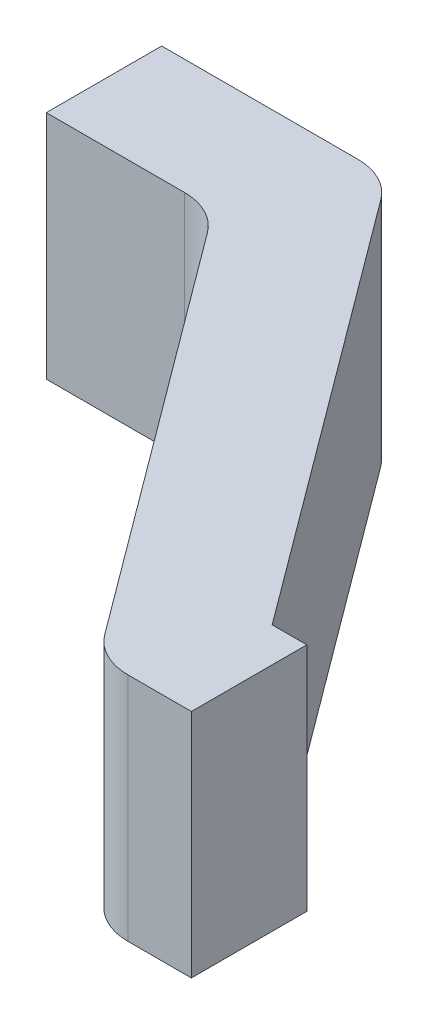
ISO-10303-21;
HEADER;
FILE_DESCRIPTION(('STEP AP214'),'2;1');
FILE_NAME('part.step','',(''),(''),'','','');
FILE_SCHEMA(('AUTOMOTIVE_DESIGN { 1 0 10303 214 1 1 1 1 }'));
ENDSEC;
DATA;
#1=APPLICATION_CONTEXT('core data for automotive mechanical design processes');
#2=APPLICATION_PROTOCOL_DEFINITION('international standard','automotive_design',2000,#1);
#3=PRODUCT_CONTEXT('',#1,'mechanical');
#4=PRODUCT('Part','Part','',(#3));
#5=PRODUCT_RELATED_PRODUCT_CATEGORY('part','',(#4));
#6=PRODUCT_DEFINITION_FORMATION('','',#4);
#7=PRODUCT_DEFINITION_CONTEXT('part definition',#1,'design');
#8=PRODUCT_DEFINITION('design','',#6,#7);
#9=PRODUCT_DEFINITION_SHAPE('','',#8);
#10=(LENGTH_UNIT() NAMED_UNIT(*) SI_UNIT(.MILLI.,.METRE.));
#11=(NAMED_UNIT(*) PLANE_ANGLE_UNIT() SI_UNIT($,.RADIAN.));
#12=(NAMED_UNIT(*) SI_UNIT($,.STERADIAN.) SOLID_ANGLE_UNIT());
#13=UNCERTAINTY_MEASURE_WITH_UNIT(LENGTH_MEASURE(1.E-05),#10,'distance_accuracy_value','');
#14=(GEOMETRIC_REPRESENTATION_CONTEXT(3) GLOBAL_UNCERTAINTY_ASSIGNED_CONTEXT((#13)) GLOBAL_UNIT_ASSIGNED_CONTEXT((#10,
#11,#12)) REPRESENTATION_CONTEXT('',''));
#15=CARTESIAN_POINT('',(0.,0.,0.));
#16=DIRECTION('',(0.,0.,1.));
#17=DIRECTION('',(1.,0.,0.));
#18=AXIS2_PLACEMENT_3D('',#15,#16,#17);
#19=CARTESIAN_POINT('',(-3.,1.7,0.205));
#20=DIRECTION('',(0.,0.,1.));
#21=DIRECTION('',(1.,0.,0.));
#22=AXIS2_PLACEMENT_3D('',#19,#20,#21);
#23=PLANE('',#22);
#24=DIRECTION('',(1.,0.,0.));
#25=VECTOR('',#24,1.);
#26=CARTESIAN_POINT('',(-3.,2.11,0.205));
#27=LINE('',#26,#25);
#28=CARTESIAN_POINT('',(-3.,2.11,0.205));
#29=VERTEX_POINT('',#28);
#30=CARTESIAN_POINT('',(-2.754632601552,2.11,0.205));
#31=VERTEX_POINT('',#30);
#32=EDGE_CURVE('E11',#29,#31,#27,.T.);
#33=ORIENTED_EDGE('',*,*,#32,.F.);
#34=DIRECTION('',(0.,1.,0.));
#35=VECTOR('',#34,1.);
#36=CARTESIAN_POINT('',(-3.,1.7,0.205));
#37=LINE('',#36,#35);
#38=CARTESIAN_POINT('',(-3.,1.7,0.205));
#39=VERTEX_POINT('',#38);
#40=EDGE_CURVE('E24',#39,#29,#37,.T.);
#41=ORIENTED_EDGE('',*,*,#40,.F.);
#42=DIRECTION('',(1.,0.,0.));
#43=VECTOR('',#42,1.);
#44=CARTESIAN_POINT('',(-3.,1.7,0.205));
#45=LINE('',#44,#43);
#46=CARTESIAN_POINT('',(-2.754632601552,1.7,0.205));
#47=VERTEX_POINT('',#46);
#48=EDGE_CURVE('E186',#39,#47,#45,.T.);
#49=ORIENTED_EDGE('',*,*,#48,.T.);
#50=DIRECTION('',(0.,1.,0.));
#51=VECTOR('',#50,1.);
#52=CARTESIAN_POINT('',(-2.754632601552,1.7,0.205));
#53=LINE('',#52,#51);
#54=EDGE_CURVE('E184',#47,#31,#53,.T.);
#55=ORIENTED_EDGE('',*,*,#54,.T.);
#56=EDGE_LOOP('',(#33,#41,#49,#55));
#57=FACE_BOUND('',#56,.T.);
#58=ADVANCED_FACE('F17',(#57),#23,.T.);
#59=CARTESIAN_POINT('',(-3.,2.11,0.));
#60=DIRECTION('',(0.,1.,0.));
#61=DIRECTION('',(0.,0.,1.));
#62=AXIS2_PLACEMENT_3D('',#59,#60,#61);
#63=PLANE('',#62);
#64=DIRECTION('',(1.,0.,0.));
#65=VECTOR('',#64,1.);
#66=CARTESIAN_POINT('',(-3.,2.11,0.));
#67=LINE('',#66,#65);
#68=CARTESIAN_POINT('',(-3.,2.11,0.));
#69=VERTEX_POINT('',#68);
#70=CARTESIAN_POINT('',(-2.651544200517,2.11,0.));
#71=VERTEX_POINT('',#70);
#72=EDGE_CURVE('E182',#69,#71,#67,.T.);
#73=ORIENTED_EDGE('',*,*,#72,.F.);
#74=DIRECTION('',(0.,0.,1.));
#75=VECTOR('',#74,1.);
#76=CARTESIAN_POINT('',(-3.,2.11,0.));
#77=LINE('',#76,#75);
#78=EDGE_CURVE('E180',#69,#29,#77,.T.);
#79=ORIENTED_EDGE('',*,*,#78,.T.);
#80=ORIENTED_EDGE('',*,*,#32,.T.);
#81=CARTESIAN_POINT('',(-2.754632601552,2.11,0.3075));
#82=DIRECTION('',(0.,-1.,0.));
#83=DIRECTION('',(0.,0.,1.));
#84=AXIS2_PLACEMENT_3D('',#81,#82,#83);
#85=CIRCLE('',#84,0.1025);
#86=CARTESIAN_POINT('',(-2.672351357136,2.11,0.246376789863));
#87=VERTEX_POINT('',#86);
#88=EDGE_CURVE('E178',#31,#87,#85,.T.);
#89=ORIENTED_EDGE('',*,*,#88,.T.);
#90=DIRECTION('',(0.596324001338072,0.,0.802743847954097));
#91=VECTOR('',#90,1.);
#92=CARTESIAN_POINT('',(-2.764562488831,2.11,0.122246420274));
#93=LINE('',#92,#91);
#94=CARTESIAN_POINT('',(-2.145299532729,2.11,0.955869630411));
#95=VERTEX_POINT('',#94);
#96=EDGE_CURVE('E176',#87,#95,#93,.T.);
#97=ORIENTED_EDGE('',*,*,#96,.T.);
#98=CARTESIAN_POINT('',(-2.063018288313,2.11,0.894746420274));
#99=DIRECTION('',(0.,1.,0.));
#100=DIRECTION('',(0.,0.,1.));
#101=AXIS2_PLACEMENT_3D('',#98,#99,#100);
#102=CIRCLE('',#101,0.1025);
#103=CARTESIAN_POINT('',(-2.063018288313,2.11,0.997246420274));
#104=VERTEX_POINT('',#103);
#105=EDGE_CURVE('E120',#95,#104,#102,.T.);
#106=ORIENTED_EDGE('',*,*,#105,.T.);
#107=DIRECTION('',(1.,0.,0.));
#108=VECTOR('',#107,1.);
#109=CARTESIAN_POINT('',(-2.114562488831,2.11,0.997246420274));
#110=LINE('',#109,#108);
#111=CARTESIAN_POINT('',(-1.95,2.11,0.997246420274));
#112=VERTEX_POINT('',#111);
#113=EDGE_CURVE('E173',#104,#112,#110,.T.);
#114=ORIENTED_EDGE('',*,*,#113,.T.);
#115=DIRECTION('',(0.,0.,1.));
#116=VECTOR('',#115,1.);
#117=CARTESIAN_POINT('',(-1.95,2.11,0.792246420274));
#118=LINE('',#117,#116);
#119=CARTESIAN_POINT('',(-1.95,2.11,0.792246420274));
#120=VERTEX_POINT('',#119);
#121=EDGE_CURVE('E170',#120,#112,#118,.T.);
#122=ORIENTED_EDGE('',*,*,#121,.F.);
#123=DIRECTION('',(1.,0.,0.));
#124=VECTOR('',#123,1.);
#125=CARTESIAN_POINT('',(-2.114562488831,2.11,0.792246420274));
#126=LINE('',#125,#124);
#127=CARTESIAN_POINT('',(-2.011474087796,2.11,0.792246420274));
#128=VERTEX_POINT('',#127);
#129=EDGE_CURVE('E167',#128,#120,#126,.T.);
#130=ORIENTED_EDGE('',*,*,#129,.F.);
#131=DIRECTION('',(0.596324001338072,0.,0.802743847954097));
#132=VECTOR('',#131,1.);
#133=CARTESIAN_POINT('',(-2.6,2.11,0.));
#134=LINE('',#133,#132);
#135=CARTESIAN_POINT('',(-2.569262956102,2.11,0.0413767898629));
#136=VERTEX_POINT('',#135);
#137=EDGE_CURVE('E164',#136,#128,#134,.T.);
#138=ORIENTED_EDGE('',*,*,#137,.F.);
#139=CARTESIAN_POINT('',(-2.651544200517,2.11,0.1025));
#140=DIRECTION('',(0.,-1.,0.));
#141=DIRECTION('',(0.,0.,1.));
#142=AXIS2_PLACEMENT_3D('',#139,#140,#141);
#143=CIRCLE('',#142,0.1025);
#144=EDGE_CURVE('E161',#71,#136,#143,.T.);
#145=ORIENTED_EDGE('',*,*,#144,.F.);
#146=EDGE_LOOP('',(#73,#79,#80,#89,#97,#106,#114,#122,#130,#138,#145));
#147=FACE_BOUND('',#146,.T.);
#148=ADVANCED_FACE('F192',(#147),#63,.T.);
#149=CARTESIAN_POINT('',(-2.754632601552,1.7,0.3075));
#150=DIRECTION('',(0.,1.,0.));
#151=DIRECTION('',(0.,0.,-1.));
#152=AXIS2_PLACEMENT_3D('',#149,#150,#151);
#153=CYLINDRICAL_SURFACE('',#152,0.1025);
#154=CARTESIAN_POINT('',(-2.754632601552,1.7,0.3075));
#155=DIRECTION('',(0.,-1.,0.));
#156=DIRECTION('',(0.,0.,1.));
#157=AXIS2_PLACEMENT_3D('',#154,#155,#156);
#158=CIRCLE('',#157,0.1025);
#159=CARTESIAN_POINT('',(-2.672351357136,1.7,0.246376789863));
#160=VERTEX_POINT('',#159);
#161=EDGE_CURVE('E159',#47,#160,#158,.T.);
#162=ORIENTED_EDGE('',*,*,#161,.T.);
#163=DIRECTION('',(0.,1.,0.));
#164=VECTOR('',#163,1.);
#165=CARTESIAN_POINT('',(-2.672351357136,1.7,0.246376789863));
#166=LINE('',#165,#164);
#167=EDGE_CURVE('E102',#160,#87,#166,.T.);
#168=ORIENTED_EDGE('',*,*,#167,.T.);
#169=ORIENTED_EDGE('',*,*,#88,.F.);
#170=ORIENTED_EDGE('',*,*,#54,.F.);
#171=EDGE_LOOP('',(#162,#168,#169,#170));
#172=FACE_BOUND('',#171,.T.);
#173=ADVANCED_FACE('F216',(#172),#153,.F.);
#174=CARTESIAN_POINT('',(-3.,1.7,0.));
#175=DIRECTION('',(1.,0.,0.));
#176=DIRECTION('',(0.,0.,1.));
#177=AXIS2_PLACEMENT_3D('',#174,#175,#176);
#178=PLANE('',#177);
#179=ORIENTED_EDGE('',*,*,#40,.T.);
#180=ORIENTED_EDGE('',*,*,#78,.F.);
#181=DIRECTION('',(0.,1.,0.));
#182=VECTOR('',#181,1.);
#183=CARTESIAN_POINT('',(-3.,1.7,0.));
#184=LINE('',#183,#182);
#185=CARTESIAN_POINT('',(-3.,1.7,0.));
#186=VERTEX_POINT('',#185);
#187=EDGE_CURVE('E155',#186,#69,#184,.T.);
#188=ORIENTED_EDGE('',*,*,#187,.F.);
#189=DIRECTION('',(0.,0.,1.));
#190=VECTOR('',#189,1.);
#191=CARTESIAN_POINT('',(-3.,1.7,0.));
#192=LINE('',#191,#190);
#193=EDGE_CURVE('E152',#186,#39,#192,.T.);
#194=ORIENTED_EDGE('',*,*,#193,.T.);
#195=EDGE_LOOP('',(#179,#180,#188,#194));
#196=FACE_BOUND('',#195,.T.);
#197=ADVANCED_FACE('F189',(#196),#178,.F.);
#198=CARTESIAN_POINT('',(-3.,1.7,0.));
#199=DIRECTION('',(0.,1.,0.));
#200=DIRECTION('',(0.,0.,1.));
#201=AXIS2_PLACEMENT_3D('',#198,#199,#200);
#202=PLANE('',#201);
#203=CARTESIAN_POINT('',(-2.651544200517,1.7,0.1025));
#204=DIRECTION('',(0.,-1.,0.));
#205=DIRECTION('',(0.,0.,1.));
#206=AXIS2_PLACEMENT_3D('',#203,#204,#205);
#207=CIRCLE('',#206,0.1025);
#208=CARTESIAN_POINT('',(-2.651544200517,1.7,0.));
#209=VERTEX_POINT('',#208);
#210=CARTESIAN_POINT('',(-2.569262956102,1.7,0.0413767898629));
#211=VERTEX_POINT('',#210);
#212=EDGE_CURVE('E150',#209,#211,#207,.T.);
#213=ORIENTED_EDGE('',*,*,#212,.T.);
#214=DIRECTION('',(0.596324001338072,0.,0.802743847954097));
#215=VECTOR('',#214,1.);
#216=CARTESIAN_POINT('',(-2.6,1.7,0.));
#217=LINE('',#216,#215);
#218=CARTESIAN_POINT('',(-2.011474087796,1.7,0.792246420274));
#219=VERTEX_POINT('',#218);
#220=EDGE_CURVE('E147',#211,#219,#217,.T.);
#221=ORIENTED_EDGE('',*,*,#220,.T.);
#222=DIRECTION('',(1.,0.,0.));
#223=VECTOR('',#222,1.);
#224=CARTESIAN_POINT('',(-2.114562488831,1.7,0.792246420274));
#225=LINE('',#224,#223);
#226=CARTESIAN_POINT('',(-1.95,1.7,0.792246420274));
#227=VERTEX_POINT('',#226);
#228=EDGE_CURVE('E144',#219,#227,#225,.T.);
#229=ORIENTED_EDGE('',*,*,#228,.T.);
#230=DIRECTION('',(0.,0.,1.));
#231=VECTOR('',#230,1.);
#232=CARTESIAN_POINT('',(-1.95,1.7,0.792246420274));
#233=LINE('',#232,#231);
#234=CARTESIAN_POINT('',(-1.95,1.7,0.997246420274));
#235=VERTEX_POINT('',#234);
#236=EDGE_CURVE('E142',#227,#235,#233,.T.);
#237=ORIENTED_EDGE('',*,*,#236,.T.);
#238=DIRECTION('',(1.,0.,0.));
#239=VECTOR('',#238,1.);
#240=CARTESIAN_POINT('',(-2.114562488831,1.7,0.997246420274));
#241=LINE('',#240,#239);
#242=CARTESIAN_POINT('',(-2.063018288313,1.7,0.997246420274));
#243=VERTEX_POINT('',#242);
#244=EDGE_CURVE('E113',#243,#235,#241,.T.);
#245=ORIENTED_EDGE('',*,*,#244,.F.);
#246=CARTESIAN_POINT('',(-2.063018288313,1.7,0.894746420274));
#247=DIRECTION('',(0.,1.,0.));
#248=DIRECTION('',(0.,0.,1.));
#249=AXIS2_PLACEMENT_3D('',#246,#247,#248);
#250=CIRCLE('',#249,0.1025);
#251=CARTESIAN_POINT('',(-2.145299532729,1.7,0.955869630411));
#252=VERTEX_POINT('',#251);
#253=EDGE_CURVE('E106',#252,#243,#250,.T.);
#254=ORIENTED_EDGE('',*,*,#253,.F.);
#255=DIRECTION('',(0.596324001338072,0.,0.802743847954097));
#256=VECTOR('',#255,1.);
#257=CARTESIAN_POINT('',(-2.764562488831,1.7,0.122246420274));
#258=LINE('',#257,#256);
#259=EDGE_CURVE('E95',#160,#252,#258,.T.);
#260=ORIENTED_EDGE('',*,*,#259,.F.);
#261=ORIENTED_EDGE('',*,*,#161,.F.);
#262=ORIENTED_EDGE('',*,*,#48,.F.);
#263=ORIENTED_EDGE('',*,*,#193,.F.);
#264=DIRECTION('',(1.,0.,0.));
#265=VECTOR('',#264,1.);
#266=CARTESIAN_POINT('',(-3.,1.7,0.));
#267=LINE('',#266,#265);
#268=EDGE_CURVE('E107',#186,#209,#267,.T.);
#269=ORIENTED_EDGE('',*,*,#268,.T.);
#270=EDGE_LOOP('',(#213,#221,#229,#237,#245,#254,#260,#261,#262,#263,#269));
#271=FACE_BOUND('',#270,.T.);
#272=ADVANCED_FACE('F111',(#271),#202,.F.);
#273=CARTESIAN_POINT('',(-3.,1.7,0.));
#274=DIRECTION('',(0.,0.,1.));
#275=DIRECTION('',(1.,0.,0.));
#276=AXIS2_PLACEMENT_3D('',#273,#274,#275);
#277=PLANE('',#276);
#278=DIRECTION('',(0.,1.,0.));
#279=VECTOR('',#278,1.);
#280=CARTESIAN_POINT('',(-2.651544200517,1.7,0.));
#281=LINE('',#280,#279);
#282=EDGE_CURVE('E137',#209,#71,#281,.T.);
#283=ORIENTED_EDGE('',*,*,#282,.F.);
#284=ORIENTED_EDGE('',*,*,#268,.F.);
#285=ORIENTED_EDGE('',*,*,#187,.T.);
#286=ORIENTED_EDGE('',*,*,#72,.T.);
#287=EDGE_LOOP('',(#283,#284,#285,#286));
#288=FACE_BOUND('',#287,.T.);
#289=ADVANCED_FACE('F196',(#288),#277,.F.);
#290=CARTESIAN_POINT('',(-2.651544200517,1.7,0.1025));
#291=DIRECTION('',(0.,1.,0.));
#292=DIRECTION('',(0.,0.,-1.));
#293=AXIS2_PLACEMENT_3D('',#290,#291,#292);
#294=CYLINDRICAL_SURFACE('',#293,0.1025);
#295=ORIENTED_EDGE('',*,*,#282,.T.);
#296=ORIENTED_EDGE('',*,*,#144,.T.);
#297=DIRECTION('',(0.,1.,0.));
#298=VECTOR('',#297,1.);
#299=CARTESIAN_POINT('',(-2.569262956102,1.7,0.0413767898629));
#300=LINE('',#299,#298);
#301=EDGE_CURVE('E134',#211,#136,#300,.T.);
#302=ORIENTED_EDGE('',*,*,#301,.F.);
#303=ORIENTED_EDGE('',*,*,#212,.F.);
#304=EDGE_LOOP('',(#295,#296,#302,#303));
#305=FACE_BOUND('',#304,.T.);
#306=ADVANCED_FACE('F201',(#305),#294,.T.);
#307=CARTESIAN_POINT('',(-2.6,1.7,0.));
#308=DIRECTION('',(0.802743847954097,0.,-0.596324001338072));
#309=DIRECTION('',(0.596324001338072,0.,0.802743847954097));
#310=AXIS2_PLACEMENT_3D('',#307,#308,#309);
#311=PLANE('',#310);
#312=ORIENTED_EDGE('',*,*,#220,.F.);
#313=ORIENTED_EDGE('',*,*,#301,.T.);
#314=ORIENTED_EDGE('',*,*,#137,.T.);
#315=DIRECTION('',(0.,1.,0.));
#316=VECTOR('',#315,1.);
#317=CARTESIAN_POINT('',(-2.011474087796,1.7,0.792246420274));
#318=LINE('',#317,#316);
#319=EDGE_CURVE('E131',#219,#128,#318,.T.);
#320=ORIENTED_EDGE('',*,*,#319,.F.);
#321=EDGE_LOOP('',(#312,#313,#314,#320));
#322=FACE_BOUND('',#321,.T.);
#323=ADVANCED_FACE('F203',(#322),#311,.T.);
#324=CARTESIAN_POINT('',(-2.114562488831,1.7,0.792246420274));
#325=DIRECTION('',(0.,0.,1.));
#326=DIRECTION('',(1.,0.,0.));
#327=AXIS2_PLACEMENT_3D('',#324,#325,#326);
#328=PLANE('',#327);
#329=DIRECTION('',(0.,1.,0.));
#330=VECTOR('',#329,1.);
#331=CARTESIAN_POINT('',(-1.95,1.7,0.792246420274));
#332=LINE('',#331,#330);
#333=EDGE_CURVE('E125',#227,#120,#332,.T.);
#334=ORIENTED_EDGE('',*,*,#333,.F.);
#335=ORIENTED_EDGE('',*,*,#228,.F.);
#336=ORIENTED_EDGE('',*,*,#319,.T.);
#337=ORIENTED_EDGE('',*,*,#129,.T.);
#338=EDGE_LOOP('',(#334,#335,#336,#337));
#339=FACE_BOUND('',#338,.T.);
#340=ADVANCED_FACE('F208',(#339),#328,.F.);
#341=CARTESIAN_POINT('',(-1.95,1.7,0.792246420274));
#342=DIRECTION('',(1.,0.,0.));
#343=DIRECTION('',(0.,0.,1.));
#344=AXIS2_PLACEMENT_3D('',#341,#342,#343);
#345=PLANE('',#344);
#346=ORIENTED_EDGE('',*,*,#236,.F.);
#347=ORIENTED_EDGE('',*,*,#333,.T.);
#348=ORIENTED_EDGE('',*,*,#121,.T.);
#349=DIRECTION('',(0.,1.,0.));
#350=VECTOR('',#349,1.);
#351=CARTESIAN_POINT('',(-1.95,1.7,0.997246420274));
#352=LINE('',#351,#350);
#353=EDGE_CURVE('E121',#235,#112,#352,.T.);
#354=ORIENTED_EDGE('',*,*,#353,.F.);
#355=EDGE_LOOP('',(#346,#347,#348,#354));
#356=FACE_BOUND('',#355,.T.);
#357=ADVANCED_FACE('F210',(#356),#345,.T.);
#358=CARTESIAN_POINT('',(-2.764562488831,1.7,0.122246420274));
#359=DIRECTION('',(0.802743847954097,0.,-0.596324001338072));
#360=DIRECTION('',(0.596324001338072,0.,0.802743847954097));
#361=AXIS2_PLACEMENT_3D('',#358,#359,#360);
#362=PLANE('',#361);
#363=DIRECTION('',(0.,1.,0.));
#364=VECTOR('',#363,1.);
#365=CARTESIAN_POINT('',(-2.145299532729,1.7,0.955869630411));
#366=LINE('',#365,#364);
#367=EDGE_CURVE('E100',#252,#95,#366,.T.);
#368=ORIENTED_EDGE('',*,*,#367,.T.);
#369=ORIENTED_EDGE('',*,*,#96,.F.);
#370=ORIENTED_EDGE('',*,*,#167,.F.);
#371=ORIENTED_EDGE('',*,*,#259,.T.);
#372=EDGE_LOOP('',(#368,#369,#370,#371));
#373=FACE_BOUND('',#372,.T.);
#374=ADVANCED_FACE('F97',(#373),#362,.F.);
#375=CARTESIAN_POINT('',(-2.114562488831,1.7,0.997246420274));
#376=DIRECTION('',(0.,0.,1.));
#377=DIRECTION('',(1.,0.,0.));
#378=AXIS2_PLACEMENT_3D('',#375,#376,#377);
#379=PLANE('',#378);
#380=ORIENTED_EDGE('',*,*,#244,.T.);
#381=ORIENTED_EDGE('',*,*,#353,.T.);
#382=ORIENTED_EDGE('',*,*,#113,.F.);
#383=DIRECTION('',(0.,1.,0.));
#384=VECTOR('',#383,1.);
#385=CARTESIAN_POINT('',(-2.063018288313,1.7,0.997246420274));
#386=LINE('',#385,#384);
#387=EDGE_CURVE('E122',#243,#104,#386,.T.);
#388=ORIENTED_EDGE('',*,*,#387,.F.);
#389=EDGE_LOOP('',(#380,#381,#382,#388));
#390=FACE_BOUND('',#389,.T.);
#391=ADVANCED_FACE('F213',(#390),#379,.T.);
#392=CARTESIAN_POINT('',(-2.063018288313,1.7,0.894746420274));
#393=DIRECTION('',(0.,1.,0.));
#394=DIRECTION('',(-0.802743847954097,0.,0.596324001338072));
#395=AXIS2_PLACEMENT_3D('',#392,#393,#394);
#396=CYLINDRICAL_SURFACE('',#395,0.1025);
#397=ORIENTED_EDGE('',*,*,#253,.T.);
#398=ORIENTED_EDGE('',*,*,#387,.T.);
#399=ORIENTED_EDGE('',*,*,#105,.F.);
#400=ORIENTED_EDGE('',*,*,#367,.F.);
#401=EDGE_LOOP('',(#397,#398,#399,#400));
#402=FACE_BOUND('',#401,.T.);
#403=ADVANCED_FACE('F119',(#402),#396,.T.);
#404=CLOSED_SHELL('',(#58,#148,#173,#197,#272,#289,#306,#323,#340,#357,#374,#391,#403));
#405=MANIFOLD_SOLID_BREP('B1',#404);
#406=ADVANCED_BREP_SHAPE_REPRESENTATION('',(#18,#405),#14);
#407=SHAPE_DEFINITION_REPRESENTATION(#9,#406);
ENDSEC;
END-ISO-10303-21;
